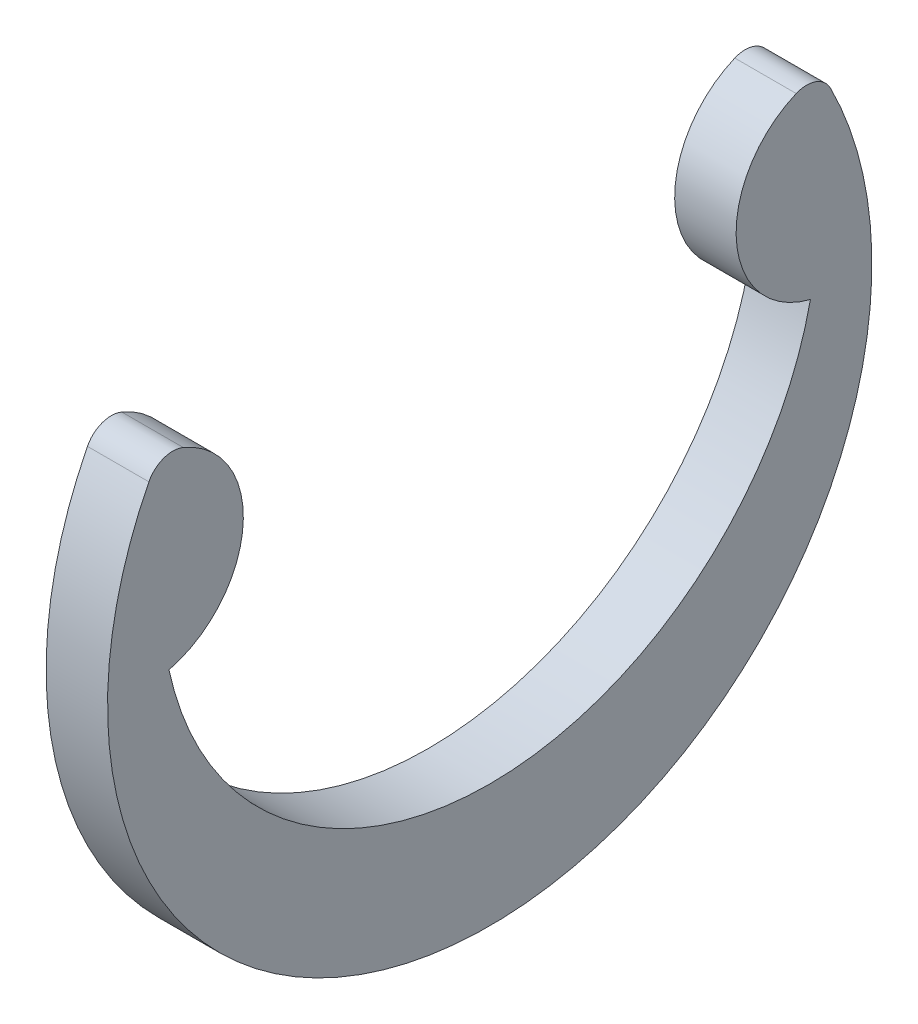
ISO-10303-21;
HEADER;
FILE_DESCRIPTION(('STEP AP214'),'2;1');
FILE_NAME('part.step','',(''),(''),'','','');
FILE_SCHEMA(('AUTOMOTIVE_DESIGN { 1 0 10303 214 1 1 1 1 }'));
ENDSEC;
DATA;
#1=APPLICATION_CONTEXT('core data for automotive mechanical design processes');
#2=APPLICATION_PROTOCOL_DEFINITION('international standard','automotive_design',2000,#1);
#3=PRODUCT_CONTEXT('',#1,'mechanical');
#4=PRODUCT('Part','Part','',(#3));
#5=PRODUCT_RELATED_PRODUCT_CATEGORY('part','',(#4));
#6=PRODUCT_DEFINITION_FORMATION('','',#4);
#7=PRODUCT_DEFINITION_CONTEXT('part definition',#1,'design');
#8=PRODUCT_DEFINITION('design','',#6,#7);
#9=PRODUCT_DEFINITION_SHAPE('','',#8);
#10=(LENGTH_UNIT() NAMED_UNIT(*) SI_UNIT(.MILLI.,.METRE.));
#11=(NAMED_UNIT(*) PLANE_ANGLE_UNIT() SI_UNIT($,.RADIAN.));
#12=(NAMED_UNIT(*) SI_UNIT($,.STERADIAN.) SOLID_ANGLE_UNIT());
#13=UNCERTAINTY_MEASURE_WITH_UNIT(LENGTH_MEASURE(1.E-05),#10,'distance_accuracy_value','');
#14=(GEOMETRIC_REPRESENTATION_CONTEXT(3) GLOBAL_UNCERTAINTY_ASSIGNED_CONTEXT((#13)) GLOBAL_UNIT_ASSIGNED_CONTEXT((#10,
#11,#12)) REPRESENTATION_CONTEXT('',''));
#15=CARTESIAN_POINT('',(0.,0.,0.));
#16=DIRECTION('',(0.,0.,1.));
#17=DIRECTION('',(1.,0.,0.));
#18=AXIS2_PLACEMENT_3D('',#15,#16,#17);
#19=CARTESIAN_POINT('',(-0.3175,0.846512328023186,-1.77963484465552));
#20=DIRECTION('',(-1.,0.,0.));
#21=DIRECTION('',(0.,0.,-1.));
#22=AXIS2_PLACEMENT_3D('',#19,#20,#21);
#23=PLANE('',#22);
#24=CARTESIAN_POINT('',(-0.3175,0.,0.));
#25=DIRECTION('',(1.,0.,0.));
#26=DIRECTION('',(0.,0.,-1.));
#27=AXIS2_PLACEMENT_3D('',#24,#25,#26);
#28=CIRCLE('',#27,3.9497);
#29=CARTESIAN_POINT('',(-0.3175,1.78646666666667,-3.52259377999918));
#30=VERTEX_POINT('',#29);
#31=CARTESIAN_POINT('',(-0.3175,1.78646666666667,3.52259377999918));
#32=VERTEX_POINT('',#31);
#33=EDGE_CURVE('E128',#30,#32,#28,.F.);
#34=ORIENTED_EDGE('',*,*,#33,.T.);
#35=CARTESIAN_POINT('',(-0.3175,1.66096845654136,3.27513368312914));
#36=DIRECTION('',(1.,0.,0.));
#37=DIRECTION('',(0.,0.,-1.));
#38=AXIS2_PLACEMENT_3D('',#35,#36,#37);
#39=CIRCLE('',#38,0.277464052243861);
#40=CARTESIAN_POINT('',(-0.3175,1.91687954310492,3.16791513967025));
#41=VERTEX_POINT('',#40);
#42=EDGE_CURVE('E109',#32,#41,#39,.F.);
#43=ORIENTED_EDGE('',*,*,#42,.T.);
#44=CARTESIAN_POINT('',(-0.3175,0.982787689221727,3.55926968931105));
#45=DIRECTION('',(1.,0.,0.));
#46=DIRECTION('',(0.,0.,-1.));
#47=AXIS2_PLACEMENT_3D('',#44,#45,#46);
#48=CIRCLE('',#47,1.01276155881603);
#49=CARTESIAN_POINT('',(-0.3175,0.,3.3147));
#50=VERTEX_POINT('',#49);
#51=EDGE_CURVE('E105',#41,#50,#48,.F.);
#52=ORIENTED_EDGE('',*,*,#51,.T.);
#53=CARTESIAN_POINT('',(-0.3175,0.710236966824645,0.));
#54=DIRECTION('',(1.,0.,0.));
#55=DIRECTION('',(0.,0.,-1.));
#56=AXIS2_PLACEMENT_3D('',#53,#54,#55);
#57=CIRCLE('',#56,3.38993696682464);
#58=CARTESIAN_POINT('',(-0.3175,0.,-3.3147));
#59=VERTEX_POINT('',#58);
#60=EDGE_CURVE('E40',#59,#50,#57,.F.);
#61=ORIENTED_EDGE('',*,*,#60,.F.);
#62=CARTESIAN_POINT('',(-0.3175,0.982787689221727,-3.55926968931105));
#63=DIRECTION('',(1.,0.,0.));
#64=DIRECTION('',(0.,0.,-1.));
#65=AXIS2_PLACEMENT_3D('',#62,#63,#64);
#66=CIRCLE('',#65,1.01276155881603);
#67=CARTESIAN_POINT('',(-0.3175,1.91687954310492,-3.16791513967025));
#68=VERTEX_POINT('',#67);
#69=EDGE_CURVE('E95',#59,#68,#66,.F.);
#70=ORIENTED_EDGE('',*,*,#69,.T.);
#71=CARTESIAN_POINT('',(-0.3175,1.66096845654136,-3.27513368312914));
#72=DIRECTION('',(1.,0.,0.));
#73=DIRECTION('',(0.,0.,-1.));
#74=AXIS2_PLACEMENT_3D('',#71,#72,#73);
#75=CIRCLE('',#74,0.277464052243861);
#76=EDGE_CURVE('E126',#68,#30,#75,.F.);
#77=ORIENTED_EDGE('',*,*,#76,.T.);
#78=EDGE_LOOP('',(#34,#43,#52,#61,#70,#77));
#79=FACE_BOUND('',#78,.T.);
#80=ADVANCED_FACE('F37',(#79),#23,.T.);
#81=CARTESIAN_POINT('',(0.3175,0.710236966824645,0.));
#82=DIRECTION('',(-1.,0.,0.));
#83=DIRECTION('',(0.,0.,-1.));
#84=AXIS2_PLACEMENT_3D('',#81,#82,#83);
#85=CYLINDRICAL_SURFACE('',#84,3.38993696682464);
#86=DIRECTION('',(-1.,0.,0.));
#87=VECTOR('',#86,1.);
#88=CARTESIAN_POINT('',(0.3175,0.,-3.3147));
#89=LINE('',#88,#87);
#90=CARTESIAN_POINT('',(0.3175,0.,-3.3147));
#91=VERTEX_POINT('',#90);
#92=EDGE_CURVE('E84',#91,#59,#89,.T.);
#93=ORIENTED_EDGE('',*,*,#92,.T.);
#94=ORIENTED_EDGE('',*,*,#60,.T.);
#95=DIRECTION('',(-1.,0.,0.));
#96=VECTOR('',#95,1.);
#97=CARTESIAN_POINT('',(0.3175,0.,3.3147));
#98=LINE('',#97,#96);
#99=CARTESIAN_POINT('',(0.3175,0.,3.3147));
#100=VERTEX_POINT('',#99);
#101=EDGE_CURVE('E106',#50,#100,#98,.F.);
#102=ORIENTED_EDGE('',*,*,#101,.T.);
#103=CARTESIAN_POINT('',(0.3175,0.710236966824645,0.));
#104=DIRECTION('',(1.,0.,0.));
#105=DIRECTION('',(0.,0.,-1.));
#106=AXIS2_PLACEMENT_3D('',#103,#104,#105);
#107=CIRCLE('',#106,3.38993696682464);
#108=EDGE_CURVE('E91',#91,#100,#107,.F.);
#109=ORIENTED_EDGE('',*,*,#108,.F.);
#110=EDGE_LOOP('',(#93,#94,#102,#109));
#111=FACE_BOUND('',#110,.T.);
#112=ADVANCED_FACE('F86',(#111),#85,.F.);
#113=CARTESIAN_POINT('',(0.3175,0.982787689221727,3.55926968931105));
#114=DIRECTION('',(-1.,0.,0.));
#115=DIRECTION('',(0.,0.,-1.));
#116=AXIS2_PLACEMENT_3D('',#113,#114,#115);
#117=CYLINDRICAL_SURFACE('',#116,1.01276155881603);
#118=DIRECTION('',(-1.,0.,0.));
#119=VECTOR('',#118,1.);
#120=CARTESIAN_POINT('',(0.3175,1.91687954310492,3.16791513967025));
#121=LINE('',#120,#119);
#122=CARTESIAN_POINT('',(0.3175,1.91687954310492,3.16791513967025));
#123=VERTEX_POINT('',#122);
#124=EDGE_CURVE('E111',#41,#123,#121,.F.);
#125=ORIENTED_EDGE('',*,*,#124,.T.);
#126=CARTESIAN_POINT('',(0.3175,0.982787689221727,3.55926968931105));
#127=DIRECTION('',(1.,0.,0.));
#128=DIRECTION('',(0.,0.,-1.));
#129=AXIS2_PLACEMENT_3D('',#126,#127,#128);
#130=CIRCLE('',#129,1.01276155881603);
#131=EDGE_CURVE('E122',#100,#123,#130,.T.);
#132=ORIENTED_EDGE('',*,*,#131,.F.);
#133=ORIENTED_EDGE('',*,*,#101,.F.);
#134=ORIENTED_EDGE('',*,*,#51,.F.);
#135=EDGE_LOOP('',(#125,#132,#133,#134));
#136=FACE_BOUND('',#135,.T.);
#137=ADVANCED_FACE('F147',(#136),#117,.T.);
#138=CARTESIAN_POINT('',(0.3175,1.66096845654136,3.27513368312914));
#139=DIRECTION('',(-1.,0.,0.));
#140=DIRECTION('',(0.,0.,-1.));
#141=AXIS2_PLACEMENT_3D('',#138,#139,#140);
#142=CYLINDRICAL_SURFACE('',#141,0.277464052243861);
#143=CARTESIAN_POINT('',(0.3175,1.66096845654136,3.27513368312914));
#144=DIRECTION('',(1.,0.,0.));
#145=DIRECTION('',(0.,0.,-1.));
#146=AXIS2_PLACEMENT_3D('',#143,#144,#145);
#147=CIRCLE('',#146,0.277464052243861);
#148=CARTESIAN_POINT('',(0.3175,1.78646666666667,3.52259377999918));
#149=VERTEX_POINT('',#148);
#150=EDGE_CURVE('E119',#123,#149,#147,.T.);
#151=ORIENTED_EDGE('',*,*,#150,.F.);
#152=ORIENTED_EDGE('',*,*,#124,.F.);
#153=ORIENTED_EDGE('',*,*,#42,.F.);
#154=DIRECTION('',(-1.,0.,0.));
#155=VECTOR('',#154,1.);
#156=CARTESIAN_POINT('',(0.3175,1.78646666666667,3.52259377999918));
#157=LINE('',#156,#155);
#158=EDGE_CURVE('E130',#32,#149,#157,.F.);
#159=ORIENTED_EDGE('',*,*,#158,.T.);
#160=EDGE_LOOP('',(#151,#152,#153,#159));
#161=FACE_BOUND('',#160,.T.);
#162=ADVANCED_FACE('F146',(#161),#142,.T.);
#163=CARTESIAN_POINT('',(0.3175,0.,0.));
#164=DIRECTION('',(-1.,0.,0.));
#165=DIRECTION('',(0.,0.,-1.));
#166=AXIS2_PLACEMENT_3D('',#163,#164,#165);
#167=CYLINDRICAL_SURFACE('',#166,3.9497);
#168=DIRECTION('',(-1.,0.,0.));
#169=VECTOR('',#168,1.);
#170=CARTESIAN_POINT('',(0.3175,1.78646666666667,-3.52259377999918));
#171=LINE('',#170,#169);
#172=CARTESIAN_POINT('',(0.3175,1.78646666666667,-3.52259377999918));
#173=VERTEX_POINT('',#172);
#174=EDGE_CURVE('E100',#30,#173,#171,.F.);
#175=ORIENTED_EDGE('',*,*,#174,.T.);
#176=CARTESIAN_POINT('',(0.3175,0.,0.));
#177=DIRECTION('',(1.,0.,0.));
#178=DIRECTION('',(0.,0.,-1.));
#179=AXIS2_PLACEMENT_3D('',#176,#177,#178);
#180=CIRCLE('',#179,3.9497);
#181=EDGE_CURVE('E116',#149,#173,#180,.T.);
#182=ORIENTED_EDGE('',*,*,#181,.F.);
#183=ORIENTED_EDGE('',*,*,#158,.F.);
#184=ORIENTED_EDGE('',*,*,#33,.F.);
#185=EDGE_LOOP('',(#175,#182,#183,#184));
#186=FACE_BOUND('',#185,.T.);
#187=ADVANCED_FACE('F145',(#186),#167,.T.);
#188=CARTESIAN_POINT('',(0.3175,1.66096845654136,-3.27513368312914));
#189=DIRECTION('',(-1.,0.,0.));
#190=DIRECTION('',(0.,0.,-1.));
#191=AXIS2_PLACEMENT_3D('',#188,#189,#190);
#192=CYLINDRICAL_SURFACE('',#191,0.277464052243861);
#193=CARTESIAN_POINT('',(0.3175,1.66096845654136,-3.27513368312914));
#194=DIRECTION('',(1.,0.,0.));
#195=DIRECTION('',(0.,0.,-1.));
#196=AXIS2_PLACEMENT_3D('',#193,#194,#195);
#197=CIRCLE('',#196,0.277464052243861);
#198=CARTESIAN_POINT('',(0.3175,1.91687954310492,-3.16791513967025));
#199=VERTEX_POINT('',#198);
#200=EDGE_CURVE('E46',#173,#199,#197,.T.);
#201=ORIENTED_EDGE('',*,*,#200,.F.);
#202=ORIENTED_EDGE('',*,*,#174,.F.);
#203=ORIENTED_EDGE('',*,*,#76,.F.);
#204=DIRECTION('',(-1.,0.,0.));
#205=VECTOR('',#204,1.);
#206=CARTESIAN_POINT('',(0.3175,1.91687954310492,-3.16791513967025));
#207=LINE('',#206,#205);
#208=EDGE_CURVE('E92',#68,#199,#207,.F.);
#209=ORIENTED_EDGE('',*,*,#208,.T.);
#210=EDGE_LOOP('',(#201,#202,#203,#209));
#211=FACE_BOUND('',#210,.T.);
#212=ADVANCED_FACE('F140',(#211),#192,.T.);
#213=CARTESIAN_POINT('',(0.3175,0.982787689221727,-3.55926968931105));
#214=DIRECTION('',(-1.,0.,0.));
#215=DIRECTION('',(0.,0.,-1.));
#216=AXIS2_PLACEMENT_3D('',#213,#214,#215);
#217=CYLINDRICAL_SURFACE('',#216,1.01276155881603);
#218=CARTESIAN_POINT('',(0.3175,0.982787689221727,-3.55926968931105));
#219=DIRECTION('',(1.,0.,0.));
#220=DIRECTION('',(0.,0.,-1.));
#221=AXIS2_PLACEMENT_3D('',#218,#219,#220);
#222=CIRCLE('',#221,1.01276155881603);
#223=EDGE_CURVE('E11',#199,#91,#222,.T.);
#224=ORIENTED_EDGE('',*,*,#223,.F.);
#225=ORIENTED_EDGE('',*,*,#208,.F.);
#226=ORIENTED_EDGE('',*,*,#69,.F.);
#227=ORIENTED_EDGE('',*,*,#92,.F.);
#228=EDGE_LOOP('',(#224,#225,#226,#227));
#229=FACE_BOUND('',#228,.T.);
#230=ADVANCED_FACE('F96',(#229),#217,.T.);
#231=CARTESIAN_POINT('',(0.3175,0.846512328023186,-1.77963484465552));
#232=DIRECTION('',(-1.,0.,0.));
#233=DIRECTION('',(0.,0.,-1.));
#234=AXIS2_PLACEMENT_3D('',#231,#232,#233);
#235=PLANE('',#234);
#236=ORIENTED_EDGE('',*,*,#200,.T.);
#237=ORIENTED_EDGE('',*,*,#223,.T.);
#238=ORIENTED_EDGE('',*,*,#108,.T.);
#239=ORIENTED_EDGE('',*,*,#131,.T.);
#240=ORIENTED_EDGE('',*,*,#150,.T.);
#241=ORIENTED_EDGE('',*,*,#181,.T.);
#242=EDGE_LOOP('',(#236,#237,#238,#239,#240,#241));
#243=FACE_BOUND('',#242,.T.);
#244=ADVANCED_FACE('F142',(#243),#235,.F.);
#245=CLOSED_SHELL('',(#80,#112,#137,#162,#187,#212,#230,#244));
#246=MANIFOLD_SOLID_BREP('B2',#245);
#247=ADVANCED_BREP_SHAPE_REPRESENTATION('',(#18,#246),#14);
#248=SHAPE_DEFINITION_REPRESENTATION(#9,#247);
ENDSEC;
END-ISO-10303-21;
